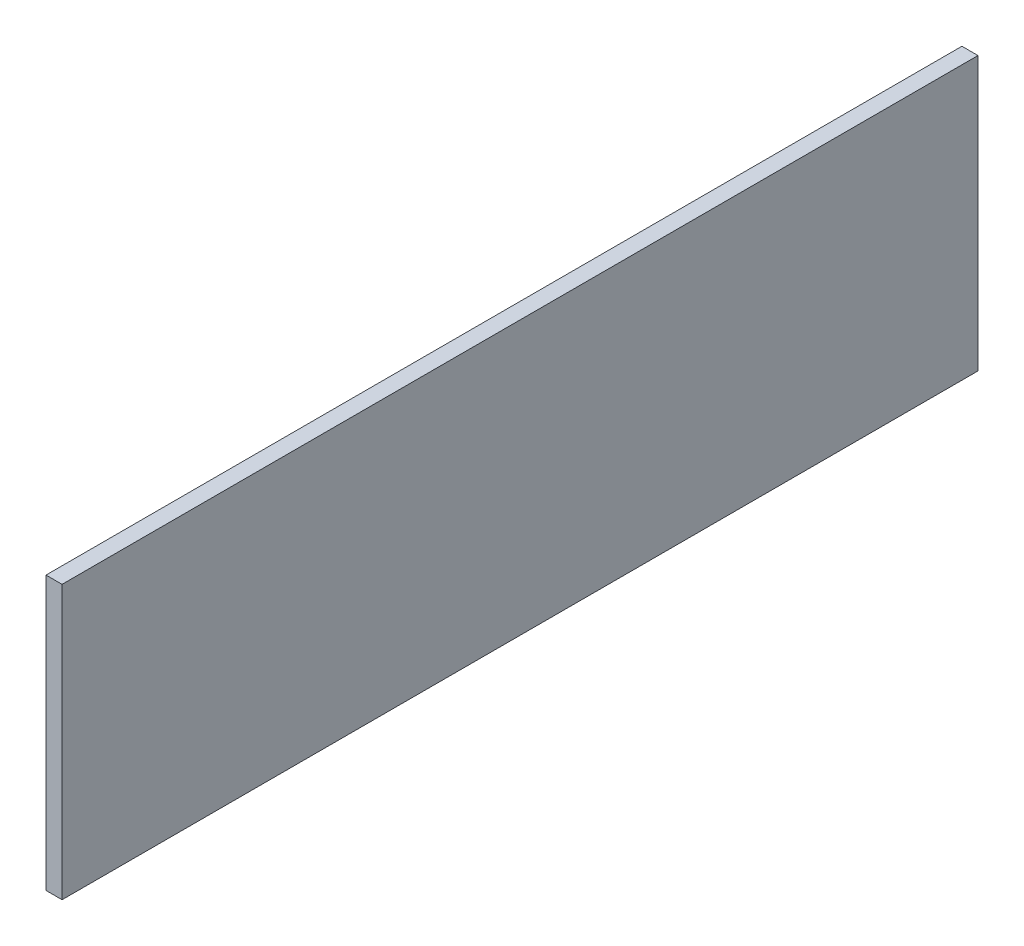
ISO-10303-21;
HEADER;
FILE_DESCRIPTION(('STEP AP214'),'2;1');
FILE_NAME('part.step','',(''),(''),'','','');
FILE_SCHEMA(('AUTOMOTIVE_DESIGN { 1 0 10303 214 1 1 1 1 }'));
ENDSEC;
DATA;
#1=APPLICATION_CONTEXT('core data for automotive mechanical design processes');
#2=APPLICATION_PROTOCOL_DEFINITION('international standard','automotive_design',2000,#1);
#3=PRODUCT_CONTEXT('',#1,'mechanical');
#4=PRODUCT('Part','Part','',(#3));
#5=PRODUCT_RELATED_PRODUCT_CATEGORY('part','',(#4));
#6=PRODUCT_DEFINITION_FORMATION('','',#4);
#7=PRODUCT_DEFINITION_CONTEXT('part definition',#1,'design');
#8=PRODUCT_DEFINITION('design','',#6,#7);
#9=PRODUCT_DEFINITION_SHAPE('','',#8);
#10=(LENGTH_UNIT() NAMED_UNIT(*) SI_UNIT(.MILLI.,.METRE.));
#11=(NAMED_UNIT(*) PLANE_ANGLE_UNIT() SI_UNIT($,.RADIAN.));
#12=(NAMED_UNIT(*) SI_UNIT($,.STERADIAN.) SOLID_ANGLE_UNIT());
#13=UNCERTAINTY_MEASURE_WITH_UNIT(LENGTH_MEASURE(1.E-05),#10,'distance_accuracy_value','');
#14=(GEOMETRIC_REPRESENTATION_CONTEXT(3) GLOBAL_UNCERTAINTY_ASSIGNED_CONTEXT((#13)) GLOBAL_UNIT_ASSIGNED_CONTEXT((#10,
#11,#12)) REPRESENTATION_CONTEXT('',''));
#15=CARTESIAN_POINT('',(0.,0.,0.));
#16=DIRECTION('',(0.,0.,1.));
#17=DIRECTION('',(1.,0.,0.));
#18=AXIS2_PLACEMENT_3D('',#15,#16,#17);
#19=CARTESIAN_POINT('',(2.54,0.,0.));
#20=DIRECTION('',(0.,0.,-1.));
#21=DIRECTION('',(-1.,0.,0.));
#22=AXIS2_PLACEMENT_3D('',#19,#20,#21);
#23=PLANE('',#22);
#24=DIRECTION('',(0.,-1.,0.));
#25=VECTOR('',#24,1.);
#26=CARTESIAN_POINT('',(0.,0.,0.));
#27=LINE('',#26,#25);
#28=CARTESIAN_POINT('',(0.,43.18,0.));
#29=VERTEX_POINT('',#28);
#30=CARTESIAN_POINT('',(0.,0.,0.));
#31=VERTEX_POINT('',#30);
#32=EDGE_CURVE('E107',#29,#31,#27,.T.);
#33=ORIENTED_EDGE('',*,*,#32,.T.);
#34=DIRECTION('',(-1.,0.,0.));
#35=VECTOR('',#34,1.);
#36=CARTESIAN_POINT('',(2.54,0.,0.));
#37=LINE('',#36,#35);
#38=CARTESIAN_POINT('',(2.54,0.,0.));
#39=VERTEX_POINT('',#38);
#40=EDGE_CURVE('E11',#39,#31,#37,.T.);
#41=ORIENTED_EDGE('',*,*,#40,.F.);
#42=DIRECTION('',(0.,-1.,0.));
#43=VECTOR('',#42,1.);
#44=CARTESIAN_POINT('',(2.54,0.,0.));
#45=LINE('',#44,#43);
#46=CARTESIAN_POINT('',(2.54,43.18,0.));
#47=VERTEX_POINT('',#46);
#48=EDGE_CURVE('E91',#47,#39,#45,.T.);
#49=ORIENTED_EDGE('',*,*,#48,.F.);
#50=DIRECTION('',(-1.,0.,0.));
#51=VECTOR('',#50,1.);
#52=CARTESIAN_POINT('',(2.54,43.18,0.));
#53=LINE('',#52,#51);
#54=EDGE_CURVE('E103',#47,#29,#53,.T.);
#55=ORIENTED_EDGE('',*,*,#54,.T.);
#56=EDGE_LOOP('',(#33,#41,#49,#55));
#57=FACE_BOUND('',#56,.T.);
#58=ADVANCED_FACE('F39',(#57),#23,.F.);
#59=CARTESIAN_POINT('',(2.54,0.,0.));
#60=DIRECTION('',(0.,1.,0.));
#61=DIRECTION('',(0.,0.,1.));
#62=AXIS2_PLACEMENT_3D('',#59,#60,#61);
#63=PLANE('',#62);
#64=DIRECTION('',(0.,0.,-1.));
#65=VECTOR('',#64,1.);
#66=CARTESIAN_POINT('',(0.,0.,0.));
#67=LINE('',#66,#65);
#68=CARTESIAN_POINT('',(0.,0.,-144.78));
#69=VERTEX_POINT('',#68);
#70=EDGE_CURVE('E96',#31,#69,#67,.T.);
#71=ORIENTED_EDGE('',*,*,#70,.T.);
#72=DIRECTION('',(-1.,0.,0.));
#73=VECTOR('',#72,1.);
#74=CARTESIAN_POINT('',(2.54,0.,-144.78));
#75=LINE('',#74,#73);
#76=CARTESIAN_POINT('',(2.54,0.,-144.78));
#77=VERTEX_POINT('',#76);
#78=EDGE_CURVE('E48',#77,#69,#75,.T.);
#79=ORIENTED_EDGE('',*,*,#78,.F.);
#80=DIRECTION('',(0.,0.,-1.));
#81=VECTOR('',#80,1.);
#82=CARTESIAN_POINT('',(2.54,0.,0.));
#83=LINE('',#82,#81);
#84=EDGE_CURVE('E86',#39,#77,#83,.T.);
#85=ORIENTED_EDGE('',*,*,#84,.F.);
#86=ORIENTED_EDGE('',*,*,#40,.T.);
#87=EDGE_LOOP('',(#71,#79,#85,#86));
#88=FACE_BOUND('',#87,.T.);
#89=ADVANCED_FACE('F95',(#88),#63,.F.);
#90=CARTESIAN_POINT('',(2.54,0.,-144.78));
#91=DIRECTION('',(0.,0.,1.));
#92=DIRECTION('',(1.,0.,0.));
#93=AXIS2_PLACEMENT_3D('',#90,#91,#92);
#94=PLANE('',#93);
#95=DIRECTION('',(0.,1.,0.));
#96=VECTOR('',#95,1.);
#97=CARTESIAN_POINT('',(0.,0.,-144.78));
#98=LINE('',#97,#96);
#99=CARTESIAN_POINT('',(0.,43.18,-144.78));
#100=VERTEX_POINT('',#99);
#101=EDGE_CURVE('E73',#69,#100,#98,.T.);
#102=ORIENTED_EDGE('',*,*,#101,.T.);
#103=DIRECTION('',(-1.,0.,0.));
#104=VECTOR('',#103,1.);
#105=CARTESIAN_POINT('',(2.54,43.18,-144.78));
#106=LINE('',#105,#104);
#107=CARTESIAN_POINT('',(2.54,43.18,-144.78));
#108=VERTEX_POINT('',#107);
#109=EDGE_CURVE('E98',#108,#100,#106,.T.);
#110=ORIENTED_EDGE('',*,*,#109,.F.);
#111=DIRECTION('',(0.,1.,0.));
#112=VECTOR('',#111,1.);
#113=CARTESIAN_POINT('',(2.54,0.,-144.78));
#114=LINE('',#113,#112);
#115=EDGE_CURVE('E89',#77,#108,#114,.T.);
#116=ORIENTED_EDGE('',*,*,#115,.F.);
#117=ORIENTED_EDGE('',*,*,#78,.T.);
#118=EDGE_LOOP('',(#102,#110,#116,#117));
#119=FACE_BOUND('',#118,.T.);
#120=ADVANCED_FACE('F99',(#119),#94,.F.);
#121=CARTESIAN_POINT('',(2.54,43.18,0.));
#122=DIRECTION('',(0.,-1.,0.));
#123=DIRECTION('',(0.,0.,-1.));
#124=AXIS2_PLACEMENT_3D('',#121,#122,#123);
#125=PLANE('',#124);
#126=DIRECTION('',(0.,0.,1.));
#127=VECTOR('',#126,1.);
#128=CARTESIAN_POINT('',(0.,43.18,0.));
#129=LINE('',#128,#127);
#130=EDGE_CURVE('E79',#100,#29,#129,.T.);
#131=ORIENTED_EDGE('',*,*,#130,.T.);
#132=ORIENTED_EDGE('',*,*,#54,.F.);
#133=DIRECTION('',(0.,0.,1.));
#134=VECTOR('',#133,1.);
#135=CARTESIAN_POINT('',(2.54,43.18,0.));
#136=LINE('',#135,#134);
#137=EDGE_CURVE('E56',#108,#47,#136,.T.);
#138=ORIENTED_EDGE('',*,*,#137,.F.);
#139=ORIENTED_EDGE('',*,*,#109,.T.);
#140=EDGE_LOOP('',(#131,#132,#138,#139));
#141=FACE_BOUND('',#140,.T.);
#142=ADVANCED_FACE('F120',(#141),#125,.F.);
#143=CARTESIAN_POINT('',(2.54,0.,0.));
#144=DIRECTION('',(-1.,0.,0.));
#145=DIRECTION('',(0.,0.,1.));
#146=AXIS2_PLACEMENT_3D('',#143,#144,#145);
#147=PLANE('',#146);
#148=ORIENTED_EDGE('',*,*,#48,.T.);
#149=ORIENTED_EDGE('',*,*,#84,.T.);
#150=ORIENTED_EDGE('',*,*,#115,.T.);
#151=ORIENTED_EDGE('',*,*,#137,.T.);
#152=EDGE_LOOP('',(#148,#149,#150,#151));
#153=FACE_BOUND('',#152,.T.);
#154=ADVANCED_FACE('F87',(#153),#147,.F.);
#155=CARTESIAN_POINT('',(0.,0.,0.));
#156=DIRECTION('',(-1.,0.,0.));
#157=DIRECTION('',(0.,0.,1.));
#158=AXIS2_PLACEMENT_3D('',#155,#156,#157);
#159=PLANE('',#158);
#160=ORIENTED_EDGE('',*,*,#32,.F.);
#161=ORIENTED_EDGE('',*,*,#130,.F.);
#162=ORIENTED_EDGE('',*,*,#101,.F.);
#163=ORIENTED_EDGE('',*,*,#70,.F.);
#164=EDGE_LOOP('',(#160,#161,#162,#163));
#165=FACE_BOUND('',#164,.T.);
#166=ADVANCED_FACE('F123',(#165),#159,.T.);
#167=CLOSED_SHELL('',(#58,#89,#120,#142,#154,#166));
#168=MANIFOLD_SOLID_BREP('B2',#167);
#169=ADVANCED_BREP_SHAPE_REPRESENTATION('',(#18,#168),#14);
#170=SHAPE_DEFINITION_REPRESENTATION(#9,#169);
ENDSEC;
END-ISO-10303-21;
